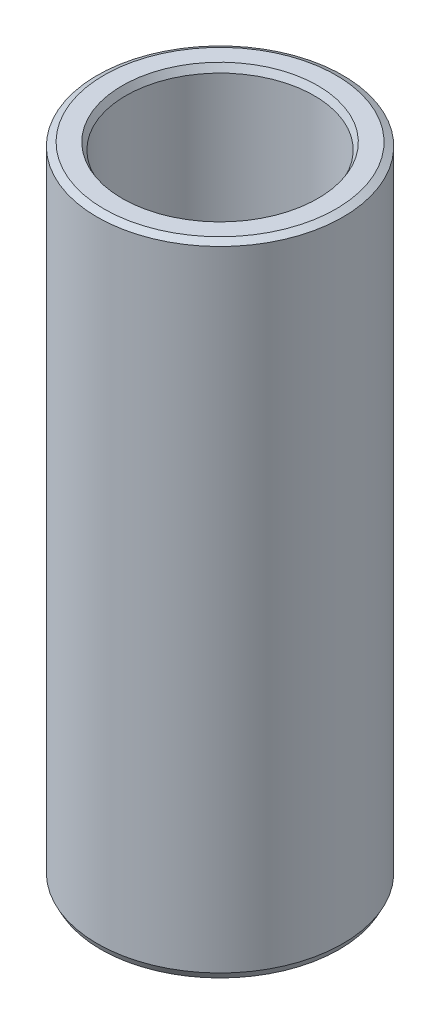
ISO-10303-21;
HEADER;
FILE_DESCRIPTION(('STEP AP214'),'2;1');
FILE_NAME('part.step','',(''),(''),'','','');
FILE_SCHEMA(('AUTOMOTIVE_DESIGN { 1 0 10303 214 1 1 1 1 }'));
ENDSEC;
DATA;
#1=APPLICATION_CONTEXT('core data for automotive mechanical design processes');
#2=APPLICATION_PROTOCOL_DEFINITION('international standard','automotive_design',2000,#1);
#3=PRODUCT_CONTEXT('',#1,'mechanical');
#4=PRODUCT('Part','Part','',(#3));
#5=PRODUCT_RELATED_PRODUCT_CATEGORY('part','',(#4));
#6=PRODUCT_DEFINITION_FORMATION('','',#4);
#7=PRODUCT_DEFINITION_CONTEXT('part definition',#1,'design');
#8=PRODUCT_DEFINITION('design','',#6,#7);
#9=PRODUCT_DEFINITION_SHAPE('','',#8);
#10=(LENGTH_UNIT() NAMED_UNIT(*) SI_UNIT(.MILLI.,.METRE.));
#11=(NAMED_UNIT(*) PLANE_ANGLE_UNIT() SI_UNIT($,.RADIAN.));
#12=(NAMED_UNIT(*) SI_UNIT($,.STERADIAN.) SOLID_ANGLE_UNIT());
#13=UNCERTAINTY_MEASURE_WITH_UNIT(LENGTH_MEASURE(1.E-05),#10,'distance_accuracy_value','');
#14=(GEOMETRIC_REPRESENTATION_CONTEXT(3) GLOBAL_UNCERTAINTY_ASSIGNED_CONTEXT((#13)) GLOBAL_UNIT_ASSIGNED_CONTEXT((#10,
#11,#12)) REPRESENTATION_CONTEXT('',''));
#15=CARTESIAN_POINT('',(0.,0.,0.));
#16=DIRECTION('',(0.,0.,1.));
#17=DIRECTION('',(1.,0.,0.));
#18=AXIS2_PLACEMENT_3D('',#15,#16,#17);
#19=CARTESIAN_POINT('',(0.,234.321484528008,0.));
#20=DIRECTION('',(0.,-1.,0.));
#21=DIRECTION('',(0.,0.,-1.));
#22=AXIS2_PLACEMENT_3D('',#19,#20,#21);
#23=CYLINDRICAL_SURFACE('',#22,45.);
#24=CARTESIAN_POINT('',(0.,2.51179575193869,0.));
#25=DIRECTION('',(0.,1.,0.));
#26=DIRECTION('',(0.,0.,1.));
#27=AXIS2_PLACEMENT_3D('',#24,#25,#26);
#28=CIRCLE('',#27,45.);
#29=CARTESIAN_POINT('',(0.,2.51179575193869,45.));
#30=VERTEX_POINT('',#29);
#31=EDGE_CURVE('E10',#30,#30,#28,.T.);
#32=ORIENTED_EDGE('',*,*,#31,.T.);
#33=EDGE_LOOP('',(#32));
#34=FACE_BOUND('',#33,.T.);
#35=CARTESIAN_POINT('',(0.,232.997457461881,0.));
#36=DIRECTION('',(0.,1.,0.));
#37=DIRECTION('',(0.,0.,1.));
#38=AXIS2_PLACEMENT_3D('',#35,#36,#37);
#39=CIRCLE('',#38,45.);
#40=CARTESIAN_POINT('',(0.,232.997457461881,45.));
#41=VERTEX_POINT('',#40);
#42=EDGE_CURVE('E50',#41,#41,#39,.F.);
#43=ORIENTED_EDGE('',*,*,#42,.T.);
#44=EDGE_LOOP('',(#43));
#45=FACE_BOUND('',#44,.T.);
#46=ADVANCED_FACE('F39',(#34,#45),#23,.T.);
#47=CARTESIAN_POINT('',(0.,234.321484528008,0.));
#48=DIRECTION('',(0.,1.,0.));
#49=DIRECTION('',(0.,0.,1.));
#50=AXIS2_PLACEMENT_3D('',#47,#48,#49);
#51=PLANE('',#50);
#52=CARTESIAN_POINT('',(0.,234.321484528008,0.));
#53=DIRECTION('',(0.,1.,0.));
#54=DIRECTION('',(0.,0.,1.));
#55=AXIS2_PLACEMENT_3D('',#52,#53,#54);
#56=CIRCLE('',#55,35.8311003070797);
#57=CARTESIAN_POINT('',(0.,234.321484528008,35.8311003070797));
#58=VERTEX_POINT('',#57);
#59=EDGE_CURVE('E58',#58,#58,#56,.F.);
#60=ORIENTED_EDGE('',*,*,#59,.T.);
#61=EDGE_LOOP('',(#60));
#62=FACE_BOUND('',#61,.T.);
#63=CARTESIAN_POINT('',(0.,234.321484528008,0.));
#64=DIRECTION('',(0.,1.,0.));
#65=DIRECTION('',(0.,0.,1.));
#66=AXIS2_PLACEMENT_3D('',#63,#64,#65);
#67=CIRCLE('',#66,42.4882042480612);
#68=CARTESIAN_POINT('',(0.,234.321484528008,42.4882042480612));
#69=VERTEX_POINT('',#68);
#70=EDGE_CURVE('E61',#69,#69,#67,.T.);
#71=ORIENTED_EDGE('',*,*,#70,.T.);
#72=EDGE_LOOP('',(#71));
#73=FACE_BOUND('',#72,.T.);
#74=ADVANCED_FACE('F88',(#62,#73),#51,.T.);
#75=CARTESIAN_POINT('',(0.,0.,0.));
#76=DIRECTION('',(0.,1.,0.));
#77=DIRECTION('',(0.,0.,1.));
#78=AXIS2_PLACEMENT_3D('',#75,#76,#77);
#79=PLANE('',#78);
#80=CARTESIAN_POINT('',(0.,0.,0.));
#81=DIRECTION('',(0.,1.,0.));
#82=DIRECTION('',(0.,0.,1.));
#83=AXIS2_PLACEMENT_3D('',#80,#81,#82);
#84=CIRCLE('',#83,37.0188689928912);
#85=CARTESIAN_POINT('',(0.,0.,37.0188689928912));
#86=VERTEX_POINT('',#85);
#87=EDGE_CURVE('E51',#86,#86,#84,.T.);
#88=ORIENTED_EDGE('',*,*,#87,.T.);
#89=EDGE_LOOP('',(#88));
#90=FACE_BOUND('',#89,.T.);
#91=CARTESIAN_POINT('',(0.,0.,0.));
#92=DIRECTION('',(0.,1.,0.));
#93=DIRECTION('',(0.,0.,1.));
#94=AXIS2_PLACEMENT_3D('',#91,#92,#93);
#95=CIRCLE('',#94,43.6759729338727);
#96=CARTESIAN_POINT('',(0.,0.,43.6759729338727));
#97=VERTEX_POINT('',#96);
#98=EDGE_CURVE('E54',#97,#97,#95,.F.);
#99=ORIENTED_EDGE('',*,*,#98,.T.);
#100=EDGE_LOOP('',(#99));
#101=FACE_BOUND('',#100,.T.);
#102=ADVANCED_FACE('F83',(#90,#101),#79,.F.);
#103=CARTESIAN_POINT('',(0.,234.321484528008,0.));
#104=DIRECTION('',(0.,-1.,0.));
#105=DIRECTION('',(0.,0.,-1.));
#106=AXIS2_PLACEMENT_3D('',#103,#104,#105);
#107=CYLINDRICAL_SURFACE('',#106,34.5070732409524);
#108=CARTESIAN_POINT('',(0.,231.809688776069,0.));
#109=DIRECTION('',(0.,1.,0.));
#110=DIRECTION('',(0.,0.,1.));
#111=AXIS2_PLACEMENT_3D('',#108,#109,#110);
#112=CIRCLE('',#111,34.5070732409524);
#113=CARTESIAN_POINT('',(0.,231.809688776069,34.5070732409524));
#114=VERTEX_POINT('',#113);
#115=EDGE_CURVE('E67',#114,#114,#112,.T.);
#116=ORIENTED_EDGE('',*,*,#115,.T.);
#117=EDGE_LOOP('',(#116));
#118=FACE_BOUND('',#117,.T.);
#119=CARTESIAN_POINT('',(0.,1.32402706612733,0.));
#120=DIRECTION('',(0.,1.,0.));
#121=DIRECTION('',(0.,0.,1.));
#122=AXIS2_PLACEMENT_3D('',#119,#120,#121);
#123=CIRCLE('',#122,34.5070732409524);
#124=CARTESIAN_POINT('',(0.,1.32402706612733,34.5070732409524));
#125=VERTEX_POINT('',#124);
#126=EDGE_CURVE('E69',#125,#125,#123,.F.);
#127=ORIENTED_EDGE('',*,*,#126,.T.);
#128=EDGE_LOOP('',(#127));
#129=FACE_BOUND('',#128,.T.);
#130=ADVANCED_FACE('F71',(#118,#129),#107,.F.);
#131=CARTESIAN_POINT('',(0.,231.809688776069,0.));
#132=DIRECTION('',(0.,1.,0.));
#133=DIRECTION('',(0.,0.,1.));
#134=AXIS2_PLACEMENT_3D('',#131,#132,#133);
#135=CONICAL_SURFACE('',#134,34.5070732409524,0.485110375813303);
#136=ORIENTED_EDGE('',*,*,#59,.F.);
#137=EDGE_LOOP('',(#136));
#138=FACE_BOUND('',#137,.T.);
#139=ORIENTED_EDGE('',*,*,#115,.F.);
#140=EDGE_LOOP('',(#139));
#141=FACE_BOUND('',#140,.T.);
#142=ADVANCED_FACE('F77',(#138,#141),#135,.F.);
#143=CARTESIAN_POINT('',(0.,0.,0.));
#144=DIRECTION('',(0.,-1.,0.));
#145=DIRECTION('',(0.,0.,-1.));
#146=AXIS2_PLACEMENT_3D('',#143,#144,#145);
#147=CONICAL_SURFACE('',#146,37.0188689928912,1.08568595098159);
#148=ORIENTED_EDGE('',*,*,#126,.F.);
#149=EDGE_LOOP('',(#148));
#150=FACE_BOUND('',#149,.T.);
#151=ORIENTED_EDGE('',*,*,#87,.F.);
#152=EDGE_LOOP('',(#151));
#153=FACE_BOUND('',#152,.T.);
#154=ADVANCED_FACE('F73',(#150,#153),#147,.F.);
#155=CARTESIAN_POINT('',(0.,2.51179575193869,0.));
#156=DIRECTION('',(0.,1.,0.));
#157=DIRECTION('',(0.,0.,1.));
#158=AXIS2_PLACEMENT_3D('',#155,#156,#157);
#159=CONICAL_SURFACE('',#158,45.,0.485110375813302);
#160=ORIENTED_EDGE('',*,*,#98,.F.);
#161=EDGE_LOOP('',(#160));
#162=FACE_BOUND('',#161,.T.);
#163=ORIENTED_EDGE('',*,*,#31,.F.);
#164=EDGE_LOOP('',(#163));
#165=FACE_BOUND('',#164,.T.);
#166=ADVANCED_FACE('F76',(#162,#165),#159,.T.);
#167=CARTESIAN_POINT('',(0.,234.321484528008,0.));
#168=DIRECTION('',(0.,-1.,0.));
#169=DIRECTION('',(0.,0.,-1.));
#170=AXIS2_PLACEMENT_3D('',#167,#168,#169);
#171=CONICAL_SURFACE('',#170,42.4882042480612,1.08568595098161);
#172=ORIENTED_EDGE('',*,*,#42,.F.);
#173=EDGE_LOOP('',(#172));
#174=FACE_BOUND('',#173,.T.);
#175=ORIENTED_EDGE('',*,*,#70,.F.);
#176=EDGE_LOOP('',(#175));
#177=FACE_BOUND('',#176,.T.);
#178=ADVANCED_FACE('F45',(#174,#177),#171,.T.);
#179=CLOSED_SHELL('',(#46,#74,#102,#130,#142,#154,#166,#178));
#180=MANIFOLD_SOLID_BREP('B2',#179);
#181=ADVANCED_BREP_SHAPE_REPRESENTATION('',(#18,#180),#14);
#182=SHAPE_DEFINITION_REPRESENTATION(#9,#181);
ENDSEC;
END-ISO-10303-21;
